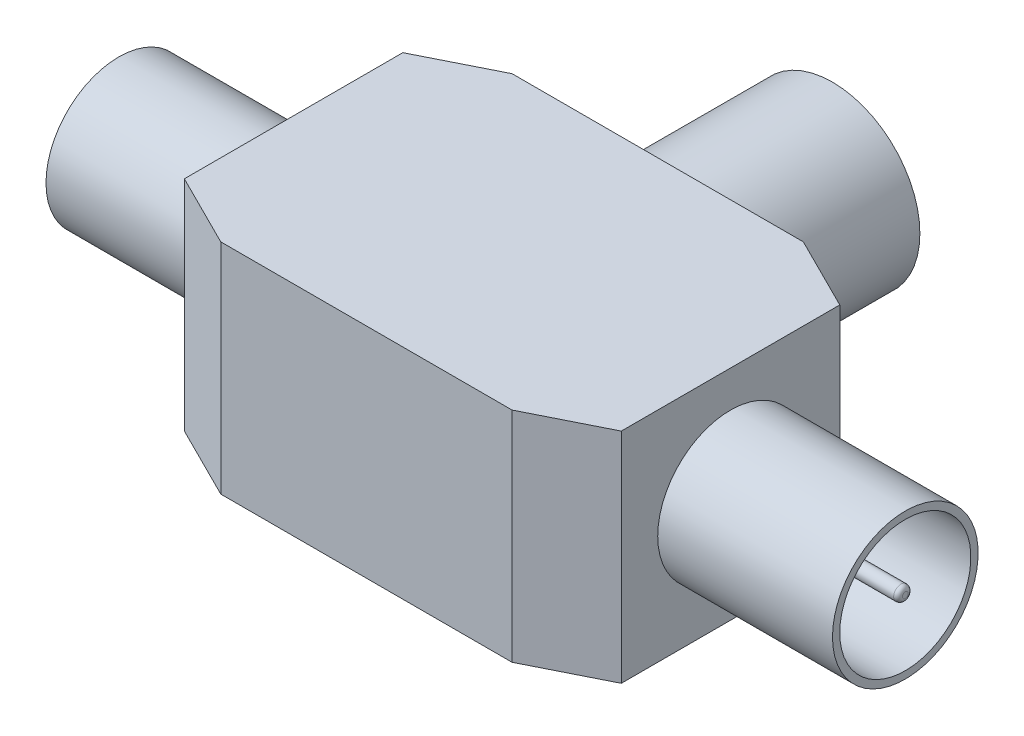
ISO-10303-21;
HEADER;
FILE_DESCRIPTION(('STEP AP214'),'2;1');
FILE_NAME('part.step','',(''),(''),'','','');
FILE_SCHEMA(('AUTOMOTIVE_DESIGN { 1 0 10303 214 1 1 1 1 }'));
ENDSEC;
DATA;
#1=APPLICATION_CONTEXT('core data for automotive mechanical design processes');
#2=APPLICATION_PROTOCOL_DEFINITION('international standard','automotive_design',2000,#1);
#3=PRODUCT_CONTEXT('',#1,'mechanical');
#4=PRODUCT('Part','Part','',(#3));
#5=PRODUCT_RELATED_PRODUCT_CATEGORY('part','',(#4));
#6=PRODUCT_DEFINITION_FORMATION('','',#4);
#7=PRODUCT_DEFINITION_CONTEXT('part definition',#1,'design');
#8=PRODUCT_DEFINITION('design','',#6,#7);
#9=PRODUCT_DEFINITION_SHAPE('','',#8);
#10=(LENGTH_UNIT() NAMED_UNIT(*) SI_UNIT(.MILLI.,.METRE.));
#11=(NAMED_UNIT(*) PLANE_ANGLE_UNIT() SI_UNIT($,.RADIAN.));
#12=(NAMED_UNIT(*) SI_UNIT($,.STERADIAN.) SOLID_ANGLE_UNIT());
#13=UNCERTAINTY_MEASURE_WITH_UNIT(LENGTH_MEASURE(1.E-05),#10,'distance_accuracy_value','');
#14=(GEOMETRIC_REPRESENTATION_CONTEXT(3) GLOBAL_UNCERTAINTY_ASSIGNED_CONTEXT((#13)) GLOBAL_UNIT_ASSIGNED_CONTEXT((#10,
#11,#12)) REPRESENTATION_CONTEXT('',''));
#15=CARTESIAN_POINT('',(0.,0.,0.));
#16=DIRECTION('',(0.,0.,1.));
#17=DIRECTION('',(1.,0.,0.));
#18=AXIS2_PLACEMENT_3D('',#15,#16,#17);
#19=CARTESIAN_POINT('',(-10.,15.,-20.));
#20=DIRECTION('',(0.,0.,1.));
#21=DIRECTION('',(1.,0.,0.));
#22=AXIS2_PLACEMENT_3D('',#19,#20,#21);
#23=PLANE('',#22);
#24=CARTESIAN_POINT('',(0.,7.5,-20.));
#25=DIRECTION('',(0.,0.,1.));
#26=DIRECTION('',(1.,0.,0.));
#27=AXIS2_PLACEMENT_3D('',#24,#25,#26);
#28=CIRCLE('',#27,6.);
#29=CARTESIAN_POINT('',(6.,7.5,-20.));
#30=VERTEX_POINT('',#29);
#31=EDGE_CURVE('E175',#30,#30,#28,.F.);
#32=ORIENTED_EDGE('',*,*,#31,.F.);
#33=EDGE_LOOP('',(#32));
#34=FACE_BOUND('',#33,.T.);
#35=DIRECTION('',(-1.,0.,0.));
#36=VECTOR('',#35,1.);
#37=CARTESIAN_POINT('',(-10.,0.,-20.));
#38=LINE('',#37,#36);
#39=CARTESIAN_POINT('',(10.,0.,-20.));
#40=VERTEX_POINT('',#39);
#41=CARTESIAN_POINT('',(-10.,0.,-20.));
#42=VERTEX_POINT('',#41);
#43=EDGE_CURVE('E145',#40,#42,#38,.T.);
#44=ORIENTED_EDGE('',*,*,#43,.T.);
#45=DIRECTION('',(0.,-1.,0.));
#46=VECTOR('',#45,1.);
#47=CARTESIAN_POINT('',(-10.,15.,-20.));
#48=LINE('',#47,#46);
#49=CARTESIAN_POINT('',(-10.,15.,-20.));
#50=VERTEX_POINT('',#49);
#51=EDGE_CURVE('E173',#50,#42,#48,.T.);
#52=ORIENTED_EDGE('',*,*,#51,.F.);
#53=DIRECTION('',(-1.,0.,0.));
#54=VECTOR('',#53,1.);
#55=CARTESIAN_POINT('',(-10.,15.,-20.));
#56=LINE('',#55,#54);
#57=CARTESIAN_POINT('',(10.,15.,-20.));
#58=VERTEX_POINT('',#57);
#59=EDGE_CURVE('E160',#58,#50,#56,.T.);
#60=ORIENTED_EDGE('',*,*,#59,.F.);
#61=DIRECTION('',(0.,-1.,0.));
#62=VECTOR('',#61,1.);
#63=CARTESIAN_POINT('',(10.,15.,-20.));
#64=LINE('',#63,#62);
#65=EDGE_CURVE('E141',#58,#40,#64,.T.);
#66=ORIENTED_EDGE('',*,*,#65,.T.);
#67=EDGE_LOOP('',(#44,#52,#60,#66));
#68=FACE_BOUND('',#67,.T.);
#69=ADVANCED_FACE('F47',(#34,#68),#23,.F.);
#70=CARTESIAN_POINT('',(-15.,15.,-17.5));
#71=DIRECTION('',(0.447213595499958,0.,0.894427190999916));
#72=DIRECTION('',(0.894427190999916,0.,-0.447213595499958));
#73=AXIS2_PLACEMENT_3D('',#70,#71,#72);
#74=PLANE('',#73);
#75=DIRECTION('',(-0.894427190999916,0.,0.447213595499958));
#76=VECTOR('',#75,1.);
#77=CARTESIAN_POINT('',(-15.,0.,-17.5));
#78=LINE('',#77,#76);
#79=CARTESIAN_POINT('',(-15.,0.,-17.5));
#80=VERTEX_POINT('',#79);
#81=EDGE_CURVE('E148',#42,#80,#78,.T.);
#82=ORIENTED_EDGE('',*,*,#81,.T.);
#83=DIRECTION('',(0.,-1.,0.));
#84=VECTOR('',#83,1.);
#85=CARTESIAN_POINT('',(-15.,15.,-17.5));
#86=LINE('',#85,#84);
#87=CARTESIAN_POINT('',(-15.,15.,-17.5));
#88=VERTEX_POINT('',#87);
#89=EDGE_CURVE('E170',#88,#80,#86,.T.);
#90=ORIENTED_EDGE('',*,*,#89,.F.);
#91=DIRECTION('',(-0.894427190999916,0.,0.447213595499958));
#92=VECTOR('',#91,1.);
#93=CARTESIAN_POINT('',(-15.,15.,-17.5));
#94=LINE('',#93,#92);
#95=EDGE_CURVE('E108',#50,#88,#94,.T.);
#96=ORIENTED_EDGE('',*,*,#95,.F.);
#97=ORIENTED_EDGE('',*,*,#51,.T.);
#98=EDGE_LOOP('',(#82,#90,#96,#97));
#99=FACE_BOUND('',#98,.T.);
#100=ADVANCED_FACE('F211',(#99),#74,.F.);
#101=CARTESIAN_POINT('',(-15.,15.,-2.5));
#102=DIRECTION('',(1.,0.,0.));
#103=DIRECTION('',(0.,0.,-1.));
#104=AXIS2_PLACEMENT_3D('',#101,#102,#103);
#105=PLANE('',#104);
#106=CARTESIAN_POINT('',(-15.,7.5,-10.));
#107=DIRECTION('',(1.,0.,0.));
#108=DIRECTION('',(0.,0.,-1.));
#109=AXIS2_PLACEMENT_3D('',#106,#107,#108);
#110=CIRCLE('',#109,5.);
#111=CARTESIAN_POINT('',(-15.,7.5,-15.));
#112=VERTEX_POINT('',#111);
#113=EDGE_CURVE('E181',#112,#112,#110,.F.);
#114=ORIENTED_EDGE('',*,*,#113,.F.);
#115=EDGE_LOOP('',(#114));
#116=FACE_BOUND('',#115,.T.);
#117=DIRECTION('',(0.,0.,1.));
#118=VECTOR('',#117,1.);
#119=CARTESIAN_POINT('',(-15.,0.,-2.5));
#120=LINE('',#119,#118);
#121=CARTESIAN_POINT('',(-15.,0.,-2.5));
#122=VERTEX_POINT('',#121);
#123=EDGE_CURVE('E151',#80,#122,#120,.T.);
#124=ORIENTED_EDGE('',*,*,#123,.T.);
#125=DIRECTION('',(0.,-1.,0.));
#126=VECTOR('',#125,1.);
#127=CARTESIAN_POINT('',(-15.,15.,-2.5));
#128=LINE('',#127,#126);
#129=CARTESIAN_POINT('',(-15.,15.,-2.5));
#130=VERTEX_POINT('',#129);
#131=EDGE_CURVE('E167',#130,#122,#128,.T.);
#132=ORIENTED_EDGE('',*,*,#131,.F.);
#133=DIRECTION('',(0.,0.,1.));
#134=VECTOR('',#133,1.);
#135=CARTESIAN_POINT('',(-15.,15.,-2.5));
#136=LINE('',#135,#134);
#137=EDGE_CURVE('E260',#88,#130,#136,.T.);
#138=ORIENTED_EDGE('',*,*,#137,.F.);
#139=ORIENTED_EDGE('',*,*,#89,.T.);
#140=EDGE_LOOP('',(#124,#132,#138,#139));
#141=FACE_BOUND('',#140,.T.);
#142=ADVANCED_FACE('F219',(#116,#141),#105,.F.);
#143=CARTESIAN_POINT('',(-15.,15.,-2.5));
#144=DIRECTION('',(0.447213595499958,0.,-0.894427190999916));
#145=DIRECTION('',(-0.894427190999916,0.,-0.447213595499958));
#146=AXIS2_PLACEMENT_3D('',#143,#144,#145);
#147=PLANE('',#146);
#148=DIRECTION('',(0.894427190999916,0.,0.447213595499958));
#149=VECTOR('',#148,1.);
#150=CARTESIAN_POINT('',(-15.,0.,-2.5));
#151=LINE('',#150,#149);
#152=CARTESIAN_POINT('',(-10.,0.,0.));
#153=VERTEX_POINT('',#152);
#154=EDGE_CURVE('E153',#122,#153,#151,.T.);
#155=ORIENTED_EDGE('',*,*,#154,.T.);
#156=DIRECTION('',(0.,-1.,0.));
#157=VECTOR('',#156,1.);
#158=CARTESIAN_POINT('',(-10.,15.,0.));
#159=LINE('',#158,#157);
#160=CARTESIAN_POINT('',(-10.,15.,0.));
#161=VERTEX_POINT('',#160);
#162=EDGE_CURVE('E164',#161,#153,#159,.T.);
#163=ORIENTED_EDGE('',*,*,#162,.F.);
#164=DIRECTION('',(0.894427190999916,0.,0.447213595499958));
#165=VECTOR('',#164,1.);
#166=CARTESIAN_POINT('',(-15.,15.,-2.5));
#167=LINE('',#166,#165);
#168=EDGE_CURVE('E262',#130,#161,#167,.T.);
#169=ORIENTED_EDGE('',*,*,#168,.F.);
#170=ORIENTED_EDGE('',*,*,#131,.T.);
#171=EDGE_LOOP('',(#155,#163,#169,#170));
#172=FACE_BOUND('',#171,.T.);
#173=ADVANCED_FACE('F268',(#172),#147,.F.);
#174=CARTESIAN_POINT('',(-10.,15.,0.));
#175=DIRECTION('',(0.,0.,-1.));
#176=DIRECTION('',(-1.,0.,0.));
#177=AXIS2_PLACEMENT_3D('',#174,#175,#176);
#178=PLANE('',#177);
#179=DIRECTION('',(1.,0.,0.));
#180=VECTOR('',#179,1.);
#181=CARTESIAN_POINT('',(-10.,0.,0.));
#182=LINE('',#181,#180);
#183=CARTESIAN_POINT('',(10.,0.,0.));
#184=VERTEX_POINT('',#183);
#185=EDGE_CURVE('E155',#153,#184,#182,.T.);
#186=ORIENTED_EDGE('',*,*,#185,.T.);
#187=DIRECTION('',(0.,-1.,0.));
#188=VECTOR('',#187,1.);
#189=CARTESIAN_POINT('',(10.,15.,0.));
#190=LINE('',#189,#188);
#191=CARTESIAN_POINT('',(10.,15.,0.));
#192=VERTEX_POINT('',#191);
#193=EDGE_CURVE('E136',#192,#184,#190,.T.);
#194=ORIENTED_EDGE('',*,*,#193,.F.);
#195=DIRECTION('',(1.,0.,0.));
#196=VECTOR('',#195,1.);
#197=CARTESIAN_POINT('',(-10.,15.,0.));
#198=LINE('',#197,#196);
#199=EDGE_CURVE('E127',#161,#192,#198,.T.);
#200=ORIENTED_EDGE('',*,*,#199,.F.);
#201=ORIENTED_EDGE('',*,*,#162,.T.);
#202=EDGE_LOOP('',(#186,#194,#200,#201));
#203=FACE_BOUND('',#202,.T.);
#204=ADVANCED_FACE('F272',(#203),#178,.F.);
#205=CARTESIAN_POINT('',(10.,15.,0.));
#206=DIRECTION('',(-0.447213595499958,0.,-0.894427190999916));
#207=DIRECTION('',(-0.894427190999916,0.,0.447213595499958));
#208=AXIS2_PLACEMENT_3D('',#205,#206,#207);
#209=PLANE('',#208);
#210=DIRECTION('',(0.894427190999916,0.,-0.447213595499958));
#211=VECTOR('',#210,1.);
#212=CARTESIAN_POINT('',(10.,0.,0.));
#213=LINE('',#212,#211);
#214=CARTESIAN_POINT('',(15.,0.,-2.5));
#215=VERTEX_POINT('',#214);
#216=EDGE_CURVE('E135',#184,#215,#213,.T.);
#217=ORIENTED_EDGE('',*,*,#216,.T.);
#218=DIRECTION('',(0.,-1.,0.));
#219=VECTOR('',#218,1.);
#220=CARTESIAN_POINT('',(15.,15.,-2.5));
#221=LINE('',#220,#219);
#222=CARTESIAN_POINT('',(15.,15.,-2.5));
#223=VERTEX_POINT('',#222);
#224=EDGE_CURVE('E132',#223,#215,#221,.T.);
#225=ORIENTED_EDGE('',*,*,#224,.F.);
#226=DIRECTION('',(0.894427190999916,0.,-0.447213595499958));
#227=VECTOR('',#226,1.);
#228=CARTESIAN_POINT('',(10.,15.,0.));
#229=LINE('',#228,#227);
#230=EDGE_CURVE('E121',#192,#223,#229,.T.);
#231=ORIENTED_EDGE('',*,*,#230,.F.);
#232=ORIENTED_EDGE('',*,*,#193,.T.);
#233=EDGE_LOOP('',(#217,#225,#231,#232));
#234=FACE_BOUND('',#233,.T.);
#235=ADVANCED_FACE('F133',(#234),#209,.F.);
#236=CARTESIAN_POINT('',(15.,15.,-2.5));
#237=DIRECTION('',(-1.,0.,0.));
#238=DIRECTION('',(0.,0.,1.));
#239=AXIS2_PLACEMENT_3D('',#236,#237,#238);
#240=PLANE('',#239);
#241=CARTESIAN_POINT('',(15.,7.5,-10.));
#242=DIRECTION('',(-1.,0.,0.));
#243=DIRECTION('',(0.,0.,1.));
#244=AXIS2_PLACEMENT_3D('',#241,#242,#243);
#245=CIRCLE('',#244,5.);
#246=CARTESIAN_POINT('',(15.,7.5,-5.));
#247=VERTEX_POINT('',#246);
#248=EDGE_CURVE('E539',#247,#247,#245,.T.);
#249=ORIENTED_EDGE('',*,*,#248,.T.);
#250=EDGE_LOOP('',(#249));
#251=FACE_BOUND('',#250,.T.);
#252=DIRECTION('',(0.,0.,-1.));
#253=VECTOR('',#252,1.);
#254=CARTESIAN_POINT('',(15.,0.,-2.5));
#255=LINE('',#254,#253);
#256=CARTESIAN_POINT('',(15.,0.,-17.5));
#257=VERTEX_POINT('',#256);
#258=EDGE_CURVE('E93',#215,#257,#255,.T.);
#259=ORIENTED_EDGE('',*,*,#258,.T.);
#260=DIRECTION('',(0.,-1.,0.));
#261=VECTOR('',#260,1.);
#262=CARTESIAN_POINT('',(15.,15.,-17.5));
#263=LINE('',#262,#261);
#264=CARTESIAN_POINT('',(15.,15.,-17.5));
#265=VERTEX_POINT('',#264);
#266=EDGE_CURVE('E137',#265,#257,#263,.T.);
#267=ORIENTED_EDGE('',*,*,#266,.F.);
#268=DIRECTION('',(0.,0.,-1.));
#269=VECTOR('',#268,1.);
#270=CARTESIAN_POINT('',(15.,15.,-2.5));
#271=LINE('',#270,#269);
#272=EDGE_CURVE('E125',#223,#265,#271,.T.);
#273=ORIENTED_EDGE('',*,*,#272,.F.);
#274=ORIENTED_EDGE('',*,*,#224,.T.);
#275=EDGE_LOOP('',(#259,#267,#273,#274));
#276=FACE_BOUND('',#275,.T.);
#277=ADVANCED_FACE('F139',(#251,#276),#240,.F.);
#278=CARTESIAN_POINT('',(10.,15.,-20.));
#279=DIRECTION('',(-0.447213595499958,0.,0.894427190999916));
#280=DIRECTION('',(0.894427190999916,0.,0.447213595499958));
#281=AXIS2_PLACEMENT_3D('',#278,#279,#280);
#282=PLANE('',#281);
#283=DIRECTION('',(-0.894427190999916,0.,-0.447213595499958));
#284=VECTOR('',#283,1.);
#285=CARTESIAN_POINT('',(10.,0.,-20.));
#286=LINE('',#285,#284);
#287=EDGE_CURVE('E99',#257,#40,#286,.T.);
#288=ORIENTED_EDGE('',*,*,#287,.T.);
#289=ORIENTED_EDGE('',*,*,#65,.F.);
#290=DIRECTION('',(-0.894427190999916,0.,-0.447213595499958));
#291=VECTOR('',#290,1.);
#292=CARTESIAN_POINT('',(10.,15.,-20.));
#293=LINE('',#292,#291);
#294=EDGE_CURVE('E64',#265,#58,#293,.T.);
#295=ORIENTED_EDGE('',*,*,#294,.F.);
#296=ORIENTED_EDGE('',*,*,#266,.T.);
#297=EDGE_LOOP('',(#288,#289,#295,#296));
#298=FACE_BOUND('',#297,.T.);
#299=ADVANCED_FACE('F279',(#298),#282,.F.);
#300=CARTESIAN_POINT('',(0.,15.,0.));
#301=DIRECTION('',(0.,1.,0.));
#302=DIRECTION('',(0.,0.,1.));
#303=AXIS2_PLACEMENT_3D('',#300,#301,#302);
#304=PLANE('',#303);
#305=ORIENTED_EDGE('',*,*,#59,.T.);
#306=ORIENTED_EDGE('',*,*,#95,.T.);
#307=ORIENTED_EDGE('',*,*,#137,.T.);
#308=ORIENTED_EDGE('',*,*,#168,.T.);
#309=ORIENTED_EDGE('',*,*,#199,.T.);
#310=ORIENTED_EDGE('',*,*,#230,.T.);
#311=ORIENTED_EDGE('',*,*,#272,.T.);
#312=ORIENTED_EDGE('',*,*,#294,.T.);
#313=EDGE_LOOP('',(#305,#306,#307,#308,#309,#310,#311,#312));
#314=FACE_BOUND('',#313,.T.);
#315=ADVANCED_FACE('F123',(#314),#304,.T.);
#316=CARTESIAN_POINT('',(0.,0.,0.));
#317=DIRECTION('',(0.,1.,0.));
#318=DIRECTION('',(0.,0.,1.));
#319=AXIS2_PLACEMENT_3D('',#316,#317,#318);
#320=PLANE('',#319);
#321=ORIENTED_EDGE('',*,*,#43,.F.);
#322=ORIENTED_EDGE('',*,*,#287,.F.);
#323=ORIENTED_EDGE('',*,*,#258,.F.);
#324=ORIENTED_EDGE('',*,*,#216,.F.);
#325=ORIENTED_EDGE('',*,*,#185,.F.);
#326=ORIENTED_EDGE('',*,*,#154,.F.);
#327=ORIENTED_EDGE('',*,*,#123,.F.);
#328=ORIENTED_EDGE('',*,*,#81,.F.);
#329=EDGE_LOOP('',(#321,#322,#323,#324,#325,#326,#327,#328));
#330=FACE_BOUND('',#329,.T.);
#331=ADVANCED_FACE('F275',(#330),#320,.F.);
#332=CARTESIAN_POINT('',(0.,7.5,-32.));
#333=DIRECTION('',(0.,0.,-1.));
#334=DIRECTION('',(-1.,0.,0.));
#335=AXIS2_PLACEMENT_3D('',#332,#333,#334);
#336=PLANE('',#335);
#337=CARTESIAN_POINT('',(0.,7.5,-32.));
#338=DIRECTION('',(0.,0.,-1.));
#339=DIRECTION('',(-1.,0.,0.));
#340=AXIS2_PLACEMENT_3D('',#337,#338,#339);
#341=CIRCLE('',#340,6.);
#342=CARTESIAN_POINT('',(-6.,7.5,-32.));
#343=VERTEX_POINT('',#342);
#344=EDGE_CURVE('E149',#343,#343,#341,.T.);
#345=ORIENTED_EDGE('',*,*,#344,.T.);
#346=EDGE_LOOP('',(#345));
#347=FACE_BOUND('',#346,.T.);
#348=CARTESIAN_POINT('',(0.,7.5,-32.));
#349=DIRECTION('',(0.,0.,-1.));
#350=DIRECTION('',(-1.,0.,0.));
#351=AXIS2_PLACEMENT_3D('',#348,#349,#350);
#352=CIRCLE('',#351,5.5);
#353=CARTESIAN_POINT('',(-5.5,7.5,-32.));
#354=VERTEX_POINT('',#353);
#355=EDGE_CURVE('E247',#354,#354,#352,.T.);
#356=ORIENTED_EDGE('',*,*,#355,.F.);
#357=EDGE_LOOP('',(#356));
#358=FACE_BOUND('',#357,.T.);
#359=ADVANCED_FACE('F360',(#347,#358),#336,.T.);
#360=CARTESIAN_POINT('',(0.,7.5,-32.));
#361=DIRECTION('',(0.,0.,1.));
#362=DIRECTION('',(1.,0.,0.));
#363=AXIS2_PLACEMENT_3D('',#360,#361,#362);
#364=CYLINDRICAL_SURFACE('',#363,6.);
#365=ORIENTED_EDGE('',*,*,#344,.F.);
#366=EDGE_LOOP('',(#365));
#367=FACE_BOUND('',#366,.T.);
#368=ORIENTED_EDGE('',*,*,#31,.T.);
#369=EDGE_LOOP('',(#368));
#370=FACE_BOUND('',#369,.T.);
#371=ADVANCED_FACE('F238',(#367,#370),#364,.T.);
#372=CARTESIAN_POINT('',(0.,7.5,-32.));
#373=DIRECTION('',(0.,0.,1.));
#374=DIRECTION('',(1.,0.,0.));
#375=AXIS2_PLACEMENT_3D('',#372,#373,#374);
#376=CYLINDRICAL_SURFACE('',#375,5.5);
#377=ORIENTED_EDGE('',*,*,#355,.T.);
#378=EDGE_LOOP('',(#377));
#379=FACE_BOUND('',#378,.T.);
#380=CARTESIAN_POINT('',(0.,7.5,-20.));
#381=DIRECTION('',(0.,0.,-1.));
#382=DIRECTION('',(-1.,0.,0.));
#383=AXIS2_PLACEMENT_3D('',#380,#381,#382);
#384=CIRCLE('',#383,5.5);
#385=CARTESIAN_POINT('',(-5.5,7.5,-20.));
#386=VERTEX_POINT('',#385);
#387=EDGE_CURVE('E245',#386,#386,#384,.T.);
#388=ORIENTED_EDGE('',*,*,#387,.F.);
#389=EDGE_LOOP('',(#388));
#390=FACE_BOUND('',#389,.T.);
#391=ADVANCED_FACE('F229',(#379,#390),#376,.F.);
#392=CARTESIAN_POINT('',(0.,7.5,-20.));
#393=DIRECTION('',(0.,0.,1.));
#394=DIRECTION('',(1.,0.,0.));
#395=AXIS2_PLACEMENT_3D('',#392,#393,#394);
#396=CIRCLE('',#395,1.);
#397=CARTESIAN_POINT('',(1.,7.5,-20.));
#398=VERTEX_POINT('',#397);
#399=EDGE_CURVE('E178',#398,#398,#396,.F.);
#400=ORIENTED_EDGE('',*,*,#399,.F.);
#401=EDGE_LOOP('',(#400));
#402=FACE_BOUND('',#401,.T.);
#403=ORIENTED_EDGE('',*,*,#387,.T.);
#404=EDGE_LOOP('',(#403));
#405=FACE_BOUND('',#404,.T.);
#406=ADVANCED_FACE('F215',(#402,#405),#23,.F.);
#407=CARTESIAN_POINT('',(0.,7.5,-32.));
#408=DIRECTION('',(0.,0.,-1.));
#409=DIRECTION('',(-1.,0.,0.));
#410=AXIS2_PLACEMENT_3D('',#407,#408,#409);
#411=PLANE('',#410);
#412=CARTESIAN_POINT('',(0.,7.5,-32.));
#413=DIRECTION('',(0.,0.,-1.));
#414=DIRECTION('',(-1.,0.,0.));
#415=AXIS2_PLACEMENT_3D('',#412,#413,#414);
#416=CIRCLE('',#415,1.);
#417=CARTESIAN_POINT('',(-1.,7.5,-32.));
#418=VERTEX_POINT('',#417);
#419=EDGE_CURVE('E248',#418,#418,#416,.T.);
#420=ORIENTED_EDGE('',*,*,#419,.T.);
#421=EDGE_LOOP('',(#420));
#422=FACE_BOUND('',#421,.T.);
#423=CARTESIAN_POINT('',(0.,7.5,-32.));
#424=DIRECTION('',(0.,0.,-1.));
#425=DIRECTION('',(-1.,0.,0.));
#426=AXIS2_PLACEMENT_3D('',#423,#424,#425);
#427=CIRCLE('',#426,0.8);
#428=CARTESIAN_POINT('',(-0.8,7.5,-32.));
#429=VERTEX_POINT('',#428);
#430=EDGE_CURVE('E253',#429,#429,#427,.T.);
#431=ORIENTED_EDGE('',*,*,#430,.F.);
#432=EDGE_LOOP('',(#431));
#433=FACE_BOUND('',#432,.T.);
#434=ADVANCED_FACE('F228',(#422,#433),#411,.T.);
#435=CARTESIAN_POINT('',(0.,7.5,-32.));
#436=DIRECTION('',(0.,0.,1.));
#437=DIRECTION('',(1.,0.,0.));
#438=AXIS2_PLACEMENT_3D('',#435,#436,#437);
#439=CYLINDRICAL_SURFACE('',#438,1.);
#440=ORIENTED_EDGE('',*,*,#419,.F.);
#441=EDGE_LOOP('',(#440));
#442=FACE_BOUND('',#441,.T.);
#443=ORIENTED_EDGE('',*,*,#399,.T.);
#444=EDGE_LOOP('',(#443));
#445=FACE_BOUND('',#444,.T.);
#446=ADVANCED_FACE('F235',(#442,#445),#439,.T.);
#447=CARTESIAN_POINT('',(0.,7.5,-32.));
#448=DIRECTION('',(0.,0.,1.));
#449=DIRECTION('',(1.,0.,0.));
#450=AXIS2_PLACEMENT_3D('',#447,#448,#449);
#451=CYLINDRICAL_SURFACE('',#450,0.8);
#452=ORIENTED_EDGE('',*,*,#430,.T.);
#453=EDGE_LOOP('',(#452));
#454=FACE_BOUND('',#453,.T.);
#455=CARTESIAN_POINT('',(0.,7.5,-20.));
#456=DIRECTION('',(0.,0.,-1.));
#457=DIRECTION('',(-1.,0.,0.));
#458=AXIS2_PLACEMENT_3D('',#455,#456,#457);
#459=CIRCLE('',#458,0.8);
#460=CARTESIAN_POINT('',(-0.8,7.5,-20.));
#461=VERTEX_POINT('',#460);
#462=EDGE_CURVE('E338',#461,#461,#459,.T.);
#463=ORIENTED_EDGE('',*,*,#462,.F.);
#464=EDGE_LOOP('',(#463));
#465=FACE_BOUND('',#464,.T.);
#466=ADVANCED_FACE('F225',(#454,#465),#451,.F.);
#467=ORIENTED_EDGE('',*,*,#462,.T.);
#468=EDGE_LOOP('',(#467));
#469=FACE_BOUND('',#468,.T.);
#470=ADVANCED_FACE('F214',(#469),#23,.F.);
#471=CARTESIAN_POINT('',(-27.,7.5,-10.));
#472=DIRECTION('',(1.,0.,0.));
#473=DIRECTION('',(0.,0.,-1.));
#474=AXIS2_PLACEMENT_3D('',#471,#472,#473);
#475=CYLINDRICAL_SURFACE('',#474,4.5);
#476=CARTESIAN_POINT('',(-27.,7.5,-10.));
#477=DIRECTION('',(-1.,0.,0.));
#478=DIRECTION('',(0.,0.,1.));
#479=AXIS2_PLACEMENT_3D('',#476,#477,#478);
#480=CIRCLE('',#479,4.5);
#481=CARTESIAN_POINT('',(-27.,7.5,-5.5));
#482=VERTEX_POINT('',#481);
#483=EDGE_CURVE('E325',#482,#482,#480,.T.);
#484=ORIENTED_EDGE('',*,*,#483,.T.);
#485=EDGE_LOOP('',(#484));
#486=FACE_BOUND('',#485,.T.);
#487=CARTESIAN_POINT('',(-15.,7.5,-10.));
#488=DIRECTION('',(-1.,0.,0.));
#489=DIRECTION('',(0.,0.,1.));
#490=AXIS2_PLACEMENT_3D('',#487,#488,#489);
#491=CIRCLE('',#490,4.5);
#492=CARTESIAN_POINT('',(-15.,7.5,-5.5));
#493=VERTEX_POINT('',#492);
#494=EDGE_CURVE('E323',#493,#493,#491,.T.);
#495=ORIENTED_EDGE('',*,*,#494,.F.);
#496=EDGE_LOOP('',(#495));
#497=FACE_BOUND('',#496,.T.);
#498=ADVANCED_FACE('F224',(#486,#497),#475,.F.);
#499=CARTESIAN_POINT('',(-27.,7.5,-10.));
#500=DIRECTION('',(1.,0.,0.));
#501=DIRECTION('',(0.,0.,-1.));
#502=AXIS2_PLACEMENT_3D('',#499,#500,#501);
#503=CYLINDRICAL_SURFACE('',#502,5.);
#504=CARTESIAN_POINT('',(-27.,7.5,-10.));
#505=DIRECTION('',(-1.,0.,0.));
#506=DIRECTION('',(0.,0.,1.));
#507=AXIS2_PLACEMENT_3D('',#504,#505,#506);
#508=CIRCLE('',#507,5.);
#509=CARTESIAN_POINT('',(-27.,7.5,-5.));
#510=VERTEX_POINT('',#509);
#511=EDGE_CURVE('E329',#510,#510,#508,.T.);
#512=ORIENTED_EDGE('',*,*,#511,.F.);
#513=EDGE_LOOP('',(#512));
#514=FACE_BOUND('',#513,.T.);
#515=ORIENTED_EDGE('',*,*,#113,.T.);
#516=EDGE_LOOP('',(#515));
#517=FACE_BOUND('',#516,.T.);
#518=ADVANCED_FACE('F316',(#514,#517),#503,.T.);
#519=CARTESIAN_POINT('',(-27.,0.,0.));
#520=DIRECTION('',(-1.,0.,0.));
#521=DIRECTION('',(0.,0.,1.));
#522=AXIS2_PLACEMENT_3D('',#519,#520,#521);
#523=PLANE('',#522);
#524=ORIENTED_EDGE('',*,*,#483,.F.);
#525=EDGE_LOOP('',(#524));
#526=FACE_BOUND('',#525,.T.);
#527=ORIENTED_EDGE('',*,*,#511,.T.);
#528=EDGE_LOOP('',(#527));
#529=FACE_BOUND('',#528,.T.);
#530=ADVANCED_FACE('F307',(#526,#529),#523,.T.);
#531=CARTESIAN_POINT('',(-15.,7.5,-10.));
#532=DIRECTION('',(1.,0.,0.));
#533=DIRECTION('',(0.,0.,-1.));
#534=AXIS2_PLACEMENT_3D('',#531,#532,#533);
#535=CIRCLE('',#534,0.500000000000001);
#536=CARTESIAN_POINT('',(-15.,7.5,-10.5));
#537=VERTEX_POINT('',#536);
#538=EDGE_CURVE('E184',#537,#537,#535,.F.);
#539=ORIENTED_EDGE('',*,*,#538,.F.);
#540=EDGE_LOOP('',(#539));
#541=FACE_BOUND('',#540,.T.);
#542=ORIENTED_EDGE('',*,*,#494,.T.);
#543=EDGE_LOOP('',(#542));
#544=FACE_BOUND('',#543,.T.);
#545=ADVANCED_FACE('F300',(#541,#544),#105,.F.);
#546=CARTESIAN_POINT('',(-27.,7.5,-10.));
#547=DIRECTION('',(1.,0.,0.));
#548=DIRECTION('',(0.,0.,-1.));
#549=AXIS2_PLACEMENT_3D('',#546,#547,#548);
#550=CYLINDRICAL_SURFACE('',#549,0.500000000000001);
#551=CARTESIAN_POINT('',(-26.7,7.5,-10.));
#552=DIRECTION('',(-1.,0.,0.));
#553=DIRECTION('',(0.,0.,1.));
#554=AXIS2_PLACEMENT_3D('',#551,#552,#553);
#555=CIRCLE('',#554,0.500000000000001);
#556=CARTESIAN_POINT('',(-26.7,7.5,-9.5));
#557=VERTEX_POINT('',#556);
#558=EDGE_CURVE('E190',#557,#557,#555,.F.);
#559=ORIENTED_EDGE('',*,*,#558,.T.);
#560=EDGE_LOOP('',(#559));
#561=FACE_BOUND('',#560,.T.);
#562=ORIENTED_EDGE('',*,*,#538,.T.);
#563=EDGE_LOOP('',(#562));
#564=FACE_BOUND('',#563,.T.);
#565=ADVANCED_FACE('F306',(#561,#564),#550,.T.);
#566=CARTESIAN_POINT('',(-27.,0.,0.));
#567=DIRECTION('',(-1.,0.,0.));
#568=DIRECTION('',(0.,0.,1.));
#569=AXIS2_PLACEMENT_3D('',#566,#567,#568);
#570=PLANE('',#569);
#571=CARTESIAN_POINT('',(-27.,7.5,-10.));
#572=DIRECTION('',(-1.,0.,0.));
#573=DIRECTION('',(0.,0.,1.));
#574=AXIS2_PLACEMENT_3D('',#571,#572,#573);
#575=CIRCLE('',#574,0.200000000000001);
#576=CARTESIAN_POINT('',(-27.,7.5,-9.8));
#577=VERTEX_POINT('',#576);
#578=EDGE_CURVE('E187',#577,#577,#575,.T.);
#579=ORIENTED_EDGE('',*,*,#578,.T.);
#580=EDGE_LOOP('',(#579));
#581=FACE_BOUND('',#580,.T.);
#582=ADVANCED_FACE('F313',(#581),#570,.T.);
#583=CARTESIAN_POINT('',(-26.7,7.5,-10.));
#584=DIRECTION('',(-1.,0.,0.));
#585=DIRECTION('',(0.,0.,1.));
#586=AXIS2_PLACEMENT_3D('',#583,#584,#585);
#587=DEGENERATE_TOROIDAL_SURFACE('',#586,0.200000000000001,0.3,.T.);
#588=ORIENTED_EDGE('',*,*,#558,.F.);
#589=EDGE_LOOP('',(#588));
#590=FACE_BOUND('',#589,.T.);
#591=ORIENTED_EDGE('',*,*,#578,.F.);
#592=EDGE_LOOP('',(#591));
#593=FACE_BOUND('',#592,.T.);
#594=ADVANCED_FACE('F452',(#590,#593),#587,.T.);
#595=CARTESIAN_POINT('',(27.,7.5,-10.));
#596=DIRECTION('',(-1.,0.,0.));
#597=DIRECTION('',(0.,0.,1.));
#598=AXIS2_PLACEMENT_3D('',#595,#596,#597);
#599=CYLINDRICAL_SURFACE('',#598,4.5);
#600=CARTESIAN_POINT('',(27.,7.5,-10.));
#601=DIRECTION('',(-1.,0.,0.));
#602=DIRECTION('',(0.,0.,1.));
#603=AXIS2_PLACEMENT_3D('',#600,#601,#602);
#604=CIRCLE('',#603,4.5);
#605=CARTESIAN_POINT('',(27.,7.5,-5.5));
#606=VERTEX_POINT('',#605);
#607=EDGE_CURVE('E332',#606,#606,#604,.T.);
#608=ORIENTED_EDGE('',*,*,#607,.F.);
#609=EDGE_LOOP('',(#608));
#610=FACE_BOUND('',#609,.T.);
#611=CARTESIAN_POINT('',(15.,7.5,-10.));
#612=DIRECTION('',(-1.,0.,0.));
#613=DIRECTION('',(0.,0.,1.));
#614=AXIS2_PLACEMENT_3D('',#611,#612,#613);
#615=CIRCLE('',#614,4.5);
#616=CARTESIAN_POINT('',(15.,7.5,-5.5));
#617=VERTEX_POINT('',#616);
#618=EDGE_CURVE('E193',#617,#617,#615,.T.);
#619=ORIENTED_EDGE('',*,*,#618,.T.);
#620=EDGE_LOOP('',(#619));
#621=FACE_BOUND('',#620,.T.);
#622=ADVANCED_FACE('F462',(#610,#621),#599,.F.);
#623=CARTESIAN_POINT('',(27.,7.5,-10.));
#624=DIRECTION('',(-1.,0.,0.));
#625=DIRECTION('',(0.,0.,1.));
#626=AXIS2_PLACEMENT_3D('',#623,#624,#625);
#627=CYLINDRICAL_SURFACE('',#626,5.);
#628=CARTESIAN_POINT('',(27.,7.5,-10.));
#629=DIRECTION('',(-1.,0.,0.));
#630=DIRECTION('',(0.,0.,1.));
#631=AXIS2_PLACEMENT_3D('',#628,#629,#630);
#632=CIRCLE('',#631,5.);
#633=CARTESIAN_POINT('',(27.,7.5,-5.));
#634=VERTEX_POINT('',#633);
#635=EDGE_CURVE('E326',#634,#634,#632,.T.);
#636=ORIENTED_EDGE('',*,*,#635,.T.);
#637=EDGE_LOOP('',(#636));
#638=FACE_BOUND('',#637,.T.);
#639=ORIENTED_EDGE('',*,*,#248,.F.);
#640=EDGE_LOOP('',(#639));
#641=FACE_BOUND('',#640,.T.);
#642=ADVANCED_FACE('F480',(#638,#641),#627,.T.);
#643=CARTESIAN_POINT('',(27.,0.,0.));
#644=DIRECTION('',(1.,0.,0.));
#645=DIRECTION('',(0.,0.,1.));
#646=AXIS2_PLACEMENT_3D('',#643,#644,#645);
#647=PLANE('',#646);
#648=ORIENTED_EDGE('',*,*,#607,.T.);
#649=EDGE_LOOP('',(#648));
#650=FACE_BOUND('',#649,.T.);
#651=ORIENTED_EDGE('',*,*,#635,.F.);
#652=EDGE_LOOP('',(#651));
#653=FACE_BOUND('',#652,.T.);
#654=ADVANCED_FACE('F490',(#650,#653),#647,.T.);
#655=CARTESIAN_POINT('',(15.,7.5,-10.));
#656=DIRECTION('',(-1.,0.,0.));
#657=DIRECTION('',(0.,0.,1.));
#658=AXIS2_PLACEMENT_3D('',#655,#656,#657);
#659=CIRCLE('',#658,0.500000000000001);
#660=CARTESIAN_POINT('',(15.,7.5,-9.5));
#661=VERTEX_POINT('',#660);
#662=EDGE_CURVE('E536',#661,#661,#659,.T.);
#663=ORIENTED_EDGE('',*,*,#662,.T.);
#664=EDGE_LOOP('',(#663));
#665=FACE_BOUND('',#664,.T.);
#666=ORIENTED_EDGE('',*,*,#618,.F.);
#667=EDGE_LOOP('',(#666));
#668=FACE_BOUND('',#667,.T.);
#669=ADVANCED_FACE('F289',(#665,#668),#240,.F.);
#670=CARTESIAN_POINT('',(27.,7.5,-10.));
#671=DIRECTION('',(-1.,0.,0.));
#672=DIRECTION('',(0.,0.,1.));
#673=AXIS2_PLACEMENT_3D('',#670,#671,#672);
#674=CYLINDRICAL_SURFACE('',#673,0.500000000000001);
#675=CARTESIAN_POINT('',(26.7,7.5,-10.));
#676=DIRECTION('',(1.,0.,0.));
#677=DIRECTION('',(0.,0.,-1.));
#678=AXIS2_PLACEMENT_3D('',#675,#676,#677);
#679=CIRCLE('',#678,0.500000000000001);
#680=CARTESIAN_POINT('',(26.7,7.5,-10.5));
#681=VERTEX_POINT('',#680);
#682=EDGE_CURVE('E56',#681,#681,#679,.F.);
#683=ORIENTED_EDGE('',*,*,#682,.T.);
#684=EDGE_LOOP('',(#683));
#685=FACE_BOUND('',#684,.T.);
#686=ORIENTED_EDGE('',*,*,#662,.F.);
#687=EDGE_LOOP('',(#686));
#688=FACE_BOUND('',#687,.T.);
#689=ADVANCED_FACE('F198',(#685,#688),#674,.T.);
#690=CARTESIAN_POINT('',(27.,0.,0.));
#691=DIRECTION('',(1.,0.,0.));
#692=DIRECTION('',(0.,0.,1.));
#693=AXIS2_PLACEMENT_3D('',#690,#691,#692);
#694=PLANE('',#693);
#695=CARTESIAN_POINT('',(27.,7.5,-10.));
#696=DIRECTION('',(1.,0.,0.));
#697=DIRECTION('',(0.,0.,-1.));
#698=AXIS2_PLACEMENT_3D('',#695,#696,#697);
#699=CIRCLE('',#698,0.200000000000001);
#700=CARTESIAN_POINT('',(27.,7.5,-10.2));
#701=VERTEX_POINT('',#700);
#702=EDGE_CURVE('E12',#701,#701,#699,.T.);
#703=ORIENTED_EDGE('',*,*,#702,.T.);
#704=EDGE_LOOP('',(#703));
#705=FACE_BOUND('',#704,.T.);
#706=ADVANCED_FACE('F202',(#705),#694,.T.);
#707=CARTESIAN_POINT('',(26.7,7.5,-10.));
#708=DIRECTION('',(1.,0.,0.));
#709=DIRECTION('',(0.,0.,-1.));
#710=AXIS2_PLACEMENT_3D('',#707,#708,#709);
#711=DEGENERATE_TOROIDAL_SURFACE('',#710,0.200000000000001,0.3,.T.);
#712=ORIENTED_EDGE('',*,*,#702,.F.);
#713=EDGE_LOOP('',(#712));
#714=FACE_BOUND('',#713,.T.);
#715=ORIENTED_EDGE('',*,*,#682,.F.);
#716=EDGE_LOOP('',(#715));
#717=FACE_BOUND('',#716,.T.);
#718=ADVANCED_FACE('F49',(#714,#717),#711,.T.);
#719=CLOSED_SHELL('',(#69,#100,#142,#173,#204,#235,#277,#299,#315,#331,#359,#371,#391,#406,#434,
#446,#466,#470,#498,#518,#530,#545,#565,#582,#594,#622,#642,#654,#669,#689,#706,#718));
#720=MANIFOLD_SOLID_BREP('B2',#719);
#721=ADVANCED_BREP_SHAPE_REPRESENTATION('',(#18,#720),#14);
#722=SHAPE_DEFINITION_REPRESENTATION(#9,#721);
ENDSEC;
END-ISO-10303-21;
